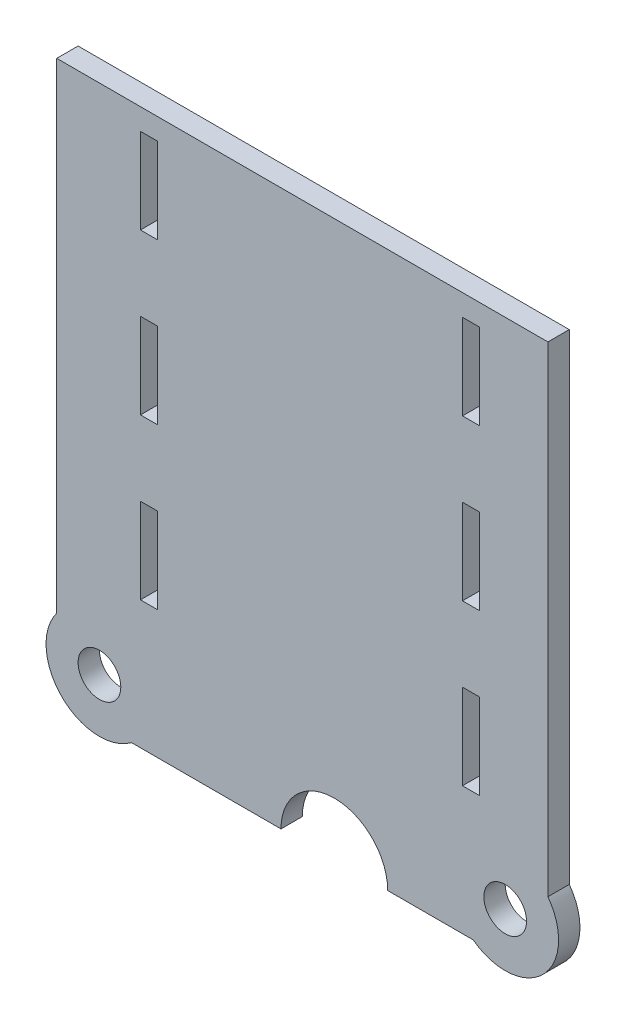
ISO-10303-21;
HEADER;
FILE_DESCRIPTION(('STEP AP214'),'2;1');
FILE_NAME('part.step','',(''),(''),'','','');
FILE_SCHEMA(('AUTOMOTIVE_DESIGN { 1 0 10303 214 1 1 1 1 }'));
ENDSEC;
DATA;
#1=APPLICATION_CONTEXT('core data for automotive mechanical design processes');
#2=APPLICATION_PROTOCOL_DEFINITION('international standard','automotive_design',2000,#1);
#3=PRODUCT_CONTEXT('',#1,'mechanical');
#4=PRODUCT('Part','Part','',(#3));
#5=PRODUCT_RELATED_PRODUCT_CATEGORY('part','',(#4));
#6=PRODUCT_DEFINITION_FORMATION('','',#4);
#7=PRODUCT_DEFINITION_CONTEXT('part definition',#1,'design');
#8=PRODUCT_DEFINITION('design','',#6,#7);
#9=PRODUCT_DEFINITION_SHAPE('','',#8);
#10=(LENGTH_UNIT() NAMED_UNIT(*) SI_UNIT(.MILLI.,.METRE.));
#11=(NAMED_UNIT(*) PLANE_ANGLE_UNIT() SI_UNIT($,.RADIAN.));
#12=(NAMED_UNIT(*) SI_UNIT($,.STERADIAN.) SOLID_ANGLE_UNIT());
#13=UNCERTAINTY_MEASURE_WITH_UNIT(LENGTH_MEASURE(1.E-05),#10,'distance_accuracy_value','');
#14=(GEOMETRIC_REPRESENTATION_CONTEXT(3) GLOBAL_UNCERTAINTY_ASSIGNED_CONTEXT((#13)) GLOBAL_UNIT_ASSIGNED_CONTEXT((#10,
#11,#12)) REPRESENTATION_CONTEXT('',''));
#15=CARTESIAN_POINT('',(0.,0.,0.));
#16=DIRECTION('',(0.,0.,1.));
#17=DIRECTION('',(1.,0.,0.));
#18=AXIS2_PLACEMENT_3D('',#15,#16,#17);
#19=CARTESIAN_POINT('',(0.,-12.7,3.175));
#20=DIRECTION('',(0.,-1.,0.));
#21=DIRECTION('',(1.,0.,0.));
#22=AXIS2_PLACEMENT_3D('',#19,#20,#21);
#23=PLANE('',#22);
#24=DIRECTION('',(0.,0.,1.));
#25=VECTOR('',#24,1.);
#26=CARTESIAN_POINT('',(25.4,-12.7,-3.175));
#27=LINE('',#26,#25);
#28=CARTESIAN_POINT('',(25.4,-12.7,-3.175));
#29=VERTEX_POINT('',#28);
#30=CARTESIAN_POINT('',(25.4,-12.7,3.175));
#31=VERTEX_POINT('',#30);
#32=EDGE_CURVE('E249',#29,#31,#27,.T.);
#33=ORIENTED_EDGE('',*,*,#32,.F.);
#34=DIRECTION('',(-1.,0.,0.));
#35=VECTOR('',#34,1.);
#36=CARTESIAN_POINT('',(0.,-12.7,-3.175));
#37=LINE('',#36,#35);
#38=CARTESIAN_POINT('',(50.8,-12.7,-3.175));
#39=VERTEX_POINT('',#38);
#40=EDGE_CURVE('E259',#39,#29,#37,.T.);
#41=ORIENTED_EDGE('',*,*,#40,.F.);
#42=DIRECTION('',(0.,0.,-1.));
#43=VECTOR('',#42,1.);
#44=CARTESIAN_POINT('',(50.8,-12.7,3.175));
#45=LINE('',#44,#43);
#46=CARTESIAN_POINT('',(50.8,-12.7,3.175));
#47=VERTEX_POINT('',#46);
#48=EDGE_CURVE('E292',#47,#39,#45,.T.);
#49=ORIENTED_EDGE('',*,*,#48,.F.);
#50=DIRECTION('',(-1.,0.,0.));
#51=VECTOR('',#50,1.);
#52=CARTESIAN_POINT('',(0.,-12.7,3.175));
#53=LINE('',#52,#51);
#54=EDGE_CURVE('E262',#47,#31,#53,.T.);
#55=ORIENTED_EDGE('',*,*,#54,.T.);
#56=EDGE_LOOP('',(#33,#41,#49,#55));
#57=FACE_BOUND('',#56,.T.);
#58=ADVANCED_FACE('F41',(#57),#23,.T.);
#59=CARTESIAN_POINT('',(1.15849359091321E-13,152.4,3.175));
#60=DIRECTION('',(0.,1.,0.));
#61=DIRECTION('',(-1.,0.,0.));
#62=AXIS2_PLACEMENT_3D('',#59,#60,#61);
#63=PLANE('',#62);
#64=DIRECTION('',(1.,0.,0.));
#65=VECTOR('',#64,1.);
#66=CARTESIAN_POINT('',(1.15849359091321E-13,152.4,-3.175));
#67=LINE('',#66,#65);
#68=CARTESIAN_POINT('',(-73.025,152.4,-3.175));
#69=VERTEX_POINT('',#68);
#70=CARTESIAN_POINT('',(73.025,152.4,-3.175));
#71=VERTEX_POINT('',#70);
#72=EDGE_CURVE('E313',#69,#71,#67,.T.);
#73=ORIENTED_EDGE('',*,*,#72,.F.);
#74=DIRECTION('',(0.,0.,-1.));
#75=VECTOR('',#74,1.);
#76=CARTESIAN_POINT('',(-73.025,152.4,3.175));
#77=LINE('',#76,#75);
#78=CARTESIAN_POINT('',(-73.025,152.4,3.175));
#79=VERTEX_POINT('',#78);
#80=EDGE_CURVE('E11',#79,#69,#77,.T.);
#81=ORIENTED_EDGE('',*,*,#80,.F.);
#82=DIRECTION('',(1.,0.,0.));
#83=VECTOR('',#82,1.);
#84=CARTESIAN_POINT('',(1.15849359091321E-13,152.4,3.175));
#85=LINE('',#84,#83);
#86=CARTESIAN_POINT('',(73.025,152.4,3.175));
#87=VERTEX_POINT('',#86);
#88=EDGE_CURVE('E286',#79,#87,#85,.T.);
#89=ORIENTED_EDGE('',*,*,#88,.T.);
#90=DIRECTION('',(0.,0.,-1.));
#91=VECTOR('',#90,1.);
#92=CARTESIAN_POINT('',(73.025,152.4,3.175));
#93=LINE('',#92,#91);
#94=EDGE_CURVE('E287',#87,#71,#93,.T.);
#95=ORIENTED_EDGE('',*,*,#94,.T.);
#96=EDGE_LOOP('',(#73,#81,#89,#95));
#97=FACE_BOUND('',#96,.T.);
#98=ADVANCED_FACE('F43',(#97),#63,.T.);
#99=CARTESIAN_POINT('',(-73.025,0.,3.175));
#100=DIRECTION('',(-1.,0.,0.));
#101=DIRECTION('',(0.,0.,1.));
#102=AXIS2_PLACEMENT_3D('',#99,#100,#101);
#103=PLANE('',#102);
#104=DIRECTION('',(0.,1.,0.));
#105=VECTOR('',#104,1.);
#106=CARTESIAN_POINT('',(-73.025,0.,-3.175));
#107=LINE('',#106,#105);
#108=CARTESIAN_POINT('',(-73.025,9.52500000000001,-3.175));
#109=VERTEX_POINT('',#108);
#110=EDGE_CURVE('E310',#109,#69,#107,.T.);
#111=ORIENTED_EDGE('',*,*,#110,.F.);
#112=DIRECTION('',(0.,0.,-1.));
#113=VECTOR('',#112,1.);
#114=CARTESIAN_POINT('',(-73.025,9.52500000000001,3.175));
#115=LINE('',#114,#113);
#116=CARTESIAN_POINT('',(-73.025,9.52500000000001,3.175));
#117=VERTEX_POINT('',#116);
#118=EDGE_CURVE('E49',#117,#109,#115,.T.);
#119=ORIENTED_EDGE('',*,*,#118,.F.);
#120=DIRECTION('',(0.,1.,0.));
#121=VECTOR('',#120,1.);
#122=CARTESIAN_POINT('',(-73.025,0.,3.175));
#123=LINE('',#122,#121);
#124=EDGE_CURVE('E330',#117,#79,#123,.T.);
#125=ORIENTED_EDGE('',*,*,#124,.T.);
#126=ORIENTED_EDGE('',*,*,#80,.T.);
#127=EDGE_LOOP('',(#111,#119,#125,#126));
#128=FACE_BOUND('',#127,.T.);
#129=ADVANCED_FACE('F311',(#128),#103,.T.);
#130=CARTESIAN_POINT('',(-60.325,0.,3.175));
#131=DIRECTION('',(0.,0.,-1.));
#132=DIRECTION('',(-1.,0.,0.));
#133=AXIS2_PLACEMENT_3D('',#130,#131,#132);
#134=CYLINDRICAL_SURFACE('',#133,15.875);
#135=CARTESIAN_POINT('',(-60.325,0.,-3.175));
#136=DIRECTION('',(0.,0.,1.));
#137=DIRECTION('',(1.,0.,0.));
#138=AXIS2_PLACEMENT_3D('',#135,#136,#137);
#139=CIRCLE('',#138,15.875);
#140=CARTESIAN_POINT('',(-50.8,-12.7,-3.175));
#141=VERTEX_POINT('',#140);
#142=EDGE_CURVE('E274',#109,#141,#139,.T.);
#143=ORIENTED_EDGE('',*,*,#142,.T.);
#144=DIRECTION('',(0.,0.,-1.));
#145=VECTOR('',#144,1.);
#146=CARTESIAN_POINT('',(-50.8,-12.7,3.175));
#147=LINE('',#146,#145);
#148=CARTESIAN_POINT('',(-50.8,-12.7,3.175));
#149=VERTEX_POINT('',#148);
#150=EDGE_CURVE('E294',#149,#141,#147,.T.);
#151=ORIENTED_EDGE('',*,*,#150,.F.);
#152=CARTESIAN_POINT('',(-60.325,0.,3.175));
#153=DIRECTION('',(0.,0.,1.));
#154=DIRECTION('',(1.,0.,0.));
#155=AXIS2_PLACEMENT_3D('',#152,#153,#154);
#156=CIRCLE('',#155,15.875);
#157=EDGE_CURVE('E303',#117,#149,#156,.T.);
#158=ORIENTED_EDGE('',*,*,#157,.F.);
#159=ORIENTED_EDGE('',*,*,#118,.T.);
#160=EDGE_LOOP('',(#143,#151,#158,#159));
#161=FACE_BOUND('',#160,.T.);
#162=ADVANCED_FACE('F300',(#161),#134,.T.);
#163=DIRECTION('',(0.,0.,1.));
#164=VECTOR('',#163,1.);
#165=CARTESIAN_POINT('',(-6.35000000000001,-12.7,-3.175));
#166=LINE('',#165,#164);
#167=CARTESIAN_POINT('',(-6.35000000000001,-12.7,3.175));
#168=VERTEX_POINT('',#167);
#169=CARTESIAN_POINT('',(-6.35000000000001,-12.7,-3.175));
#170=VERTEX_POINT('',#169);
#171=EDGE_CURVE('E56',#168,#170,#166,.F.);
#172=ORIENTED_EDGE('',*,*,#171,.F.);
#173=EDGE_CURVE('E328',#168,#149,#53,.T.);
#174=ORIENTED_EDGE('',*,*,#173,.T.);
#175=ORIENTED_EDGE('',*,*,#150,.T.);
#176=EDGE_CURVE('E270',#170,#141,#37,.T.);
#177=ORIENTED_EDGE('',*,*,#176,.F.);
#178=EDGE_LOOP('',(#172,#174,#175,#177));
#179=FACE_BOUND('',#178,.T.);
#180=ADVANCED_FACE('F526',(#179),#23,.T.);
#181=CARTESIAN_POINT('',(60.325,0.,3.175));
#182=DIRECTION('',(0.,0.,-1.));
#183=DIRECTION('',(-1.,0.,0.));
#184=AXIS2_PLACEMENT_3D('',#181,#182,#183);
#185=CYLINDRICAL_SURFACE('',#184,15.875);
#186=CARTESIAN_POINT('',(60.325,0.,-3.175));
#187=DIRECTION('',(0.,0.,1.));
#188=DIRECTION('',(1.,0.,0.));
#189=AXIS2_PLACEMENT_3D('',#186,#187,#188);
#190=CIRCLE('',#189,15.875);
#191=CARTESIAN_POINT('',(73.025,9.525,-3.175));
#192=VERTEX_POINT('',#191);
#193=EDGE_CURVE('E269',#192,#39,#190,.F.);
#194=ORIENTED_EDGE('',*,*,#193,.F.);
#195=DIRECTION('',(0.,0.,-1.));
#196=VECTOR('',#195,1.);
#197=CARTESIAN_POINT('',(73.025,9.525,3.175));
#198=LINE('',#197,#196);
#199=CARTESIAN_POINT('',(73.025,9.525,3.175));
#200=VERTEX_POINT('',#199);
#201=EDGE_CURVE('E289',#200,#192,#198,.T.);
#202=ORIENTED_EDGE('',*,*,#201,.F.);
#203=CARTESIAN_POINT('',(60.325,0.,3.175));
#204=DIRECTION('',(0.,0.,1.));
#205=DIRECTION('',(1.,0.,0.));
#206=AXIS2_PLACEMENT_3D('',#203,#204,#205);
#207=CIRCLE('',#206,15.875);
#208=EDGE_CURVE('E324',#200,#47,#207,.F.);
#209=ORIENTED_EDGE('',*,*,#208,.T.);
#210=ORIENTED_EDGE('',*,*,#48,.T.);
#211=EDGE_LOOP('',(#194,#202,#209,#210));
#212=FACE_BOUND('',#211,.T.);
#213=ADVANCED_FACE('F536',(#212),#185,.T.);
#214=CARTESIAN_POINT('',(-60.325,0.,3.175));
#215=DIRECTION('',(0.,0.,-1.));
#216=DIRECTION('',(-1.,0.,0.));
#217=AXIS2_PLACEMENT_3D('',#214,#215,#216);
#218=CYLINDRICAL_SURFACE('',#217,6.35000000000001);
#219=CARTESIAN_POINT('',(-60.325,0.,3.175));
#220=DIRECTION('',(0.,0.,1.));
#221=DIRECTION('',(1.,0.,0.));
#222=AXIS2_PLACEMENT_3D('',#219,#220,#221);
#223=CIRCLE('',#222,6.35000000000001);
#224=CARTESIAN_POINT('',(-53.975,0.,3.175));
#225=VERTEX_POINT('',#224);
#226=EDGE_CURVE('E319',#225,#225,#223,.T.);
#227=ORIENTED_EDGE('',*,*,#226,.T.);
#228=EDGE_LOOP('',(#227));
#229=FACE_BOUND('',#228,.T.);
#230=CARTESIAN_POINT('',(-60.325,0.,-3.175));
#231=DIRECTION('',(0.,0.,1.));
#232=DIRECTION('',(1.,0.,0.));
#233=AXIS2_PLACEMENT_3D('',#230,#231,#232);
#234=CIRCLE('',#233,6.35000000000001);
#235=CARTESIAN_POINT('',(-53.975,0.,-3.175));
#236=VERTEX_POINT('',#235);
#237=EDGE_CURVE('E280',#236,#236,#234,.T.);
#238=ORIENTED_EDGE('',*,*,#237,.F.);
#239=EDGE_LOOP('',(#238));
#240=FACE_BOUND('',#239,.T.);
#241=ADVANCED_FACE('F540',(#229,#240),#218,.F.);
#242=CARTESIAN_POINT('',(73.025,0.,3.175));
#243=DIRECTION('',(-1.,0.,0.));
#244=DIRECTION('',(0.,0.,1.));
#245=AXIS2_PLACEMENT_3D('',#242,#243,#244);
#246=PLANE('',#245);
#247=DIRECTION('',(0.,1.,0.));
#248=VECTOR('',#247,1.);
#249=CARTESIAN_POINT('',(73.025,0.,-3.175));
#250=LINE('',#249,#248);
#251=EDGE_CURVE('E272',#192,#71,#250,.T.);
#252=ORIENTED_EDGE('',*,*,#251,.T.);
#253=ORIENTED_EDGE('',*,*,#94,.F.);
#254=DIRECTION('',(0.,1.,0.));
#255=VECTOR('',#254,1.);
#256=CARTESIAN_POINT('',(73.025,0.,3.175));
#257=LINE('',#256,#255);
#258=EDGE_CURVE('E322',#200,#87,#257,.T.);
#259=ORIENTED_EDGE('',*,*,#258,.F.);
#260=ORIENTED_EDGE('',*,*,#201,.T.);
#261=EDGE_LOOP('',(#252,#253,#259,#260));
#262=FACE_BOUND('',#261,.T.);
#263=ADVANCED_FACE('F537',(#262),#246,.F.);
#264=CARTESIAN_POINT('',(60.325,0.,3.175));
#265=DIRECTION('',(0.,0.,-1.));
#266=DIRECTION('',(-1.,0.,0.));
#267=AXIS2_PLACEMENT_3D('',#264,#265,#266);
#268=CYLINDRICAL_SURFACE('',#267,6.35000000000001);
#269=CARTESIAN_POINT('',(60.325,0.,3.175));
#270=DIRECTION('',(0.,0.,1.));
#271=DIRECTION('',(1.,0.,0.));
#272=AXIS2_PLACEMENT_3D('',#269,#270,#271);
#273=CIRCLE('',#272,6.35000000000001);
#274=CARTESIAN_POINT('',(66.675,0.,3.175));
#275=VERTEX_POINT('',#274);
#276=EDGE_CURVE('E290',#275,#275,#273,.F.);
#277=ORIENTED_EDGE('',*,*,#276,.F.);
#278=EDGE_LOOP('',(#277));
#279=FACE_BOUND('',#278,.T.);
#280=CARTESIAN_POINT('',(60.325,0.,-3.175));
#281=DIRECTION('',(0.,0.,1.));
#282=DIRECTION('',(1.,0.,0.));
#283=AXIS2_PLACEMENT_3D('',#280,#281,#282);
#284=CIRCLE('',#283,6.35000000000001);
#285=CARTESIAN_POINT('',(66.675,0.,-3.175));
#286=VERTEX_POINT('',#285);
#287=EDGE_CURVE('E283',#286,#286,#284,.F.);
#288=ORIENTED_EDGE('',*,*,#287,.T.);
#289=EDGE_LOOP('',(#288));
#290=FACE_BOUND('',#289,.T.);
#291=ADVANCED_FACE('F539',(#279,#290),#268,.F.);
#292=CARTESIAN_POINT('',(0.,0.,3.175));
#293=DIRECTION('',(0.,0.,1.));
#294=DIRECTION('',(1.,0.,0.));
#295=AXIS2_PLACEMENT_3D('',#292,#293,#294);
#296=PLANE('',#295);
#297=CARTESIAN_POINT('',(9.52499999999999,-12.7,3.175));
#298=DIRECTION('',(0.,0.,1.));
#299=DIRECTION('',(1.,0.,0.));
#300=AXIS2_PLACEMENT_3D('',#297,#298,#299);
#301=CIRCLE('',#300,15.875);
#302=EDGE_CURVE('E254',#31,#168,#301,.T.);
#303=ORIENTED_EDGE('',*,*,#302,.F.);
#304=ORIENTED_EDGE('',*,*,#54,.F.);
#305=ORIENTED_EDGE('',*,*,#208,.F.);
#306=ORIENTED_EDGE('',*,*,#258,.T.);
#307=ORIENTED_EDGE('',*,*,#88,.F.);
#308=ORIENTED_EDGE('',*,*,#124,.F.);
#309=ORIENTED_EDGE('',*,*,#157,.T.);
#310=ORIENTED_EDGE('',*,*,#173,.F.);
#311=EDGE_LOOP('',(#303,#304,#305,#306,#307,#308,#309,#310));
#312=FACE_BOUND('',#311,.T.);
#313=DIRECTION('',(0.,-1.,0.));
#314=VECTOR('',#313,1.);
#315=CARTESIAN_POINT('',(-48.133,98.425,3.175));
#316=LINE('',#315,#314);
#317=CARTESIAN_POINT('',(-48.133,98.425,3.175));
#318=VERTEX_POINT('',#317);
#319=CARTESIAN_POINT('',(-48.133,73.025,3.175));
#320=VERTEX_POINT('',#319);
#321=EDGE_CURVE('E64',#318,#320,#316,.T.);
#322=ORIENTED_EDGE('',*,*,#321,.F.);
#323=DIRECTION('',(-1.,0.,0.));
#324=VECTOR('',#323,1.);
#325=CARTESIAN_POINT('',(-48.133,98.425,3.175));
#326=LINE('',#325,#324);
#327=CARTESIAN_POINT('',(-43.053,98.425,3.175));
#328=VERTEX_POINT('',#327);
#329=EDGE_CURVE('E471',#328,#318,#326,.T.);
#330=ORIENTED_EDGE('',*,*,#329,.F.);
#331=DIRECTION('',(0.,1.,0.));
#332=VECTOR('',#331,1.);
#333=CARTESIAN_POINT('',(-43.053,98.425,3.175));
#334=LINE('',#333,#332);
#335=CARTESIAN_POINT('',(-43.053,73.025,3.175));
#336=VERTEX_POINT('',#335);
#337=EDGE_CURVE('E475',#336,#328,#334,.T.);
#338=ORIENTED_EDGE('',*,*,#337,.F.);
#339=DIRECTION('',(1.,0.,0.));
#340=VECTOR('',#339,1.);
#341=CARTESIAN_POINT('',(-48.133,73.025,3.175));
#342=LINE('',#341,#340);
#343=EDGE_CURVE('E478',#320,#336,#342,.T.);
#344=ORIENTED_EDGE('',*,*,#343,.F.);
#345=EDGE_LOOP('',(#322,#330,#338,#344));
#346=FACE_BOUND('',#345,.T.);
#347=DIRECTION('',(0.,-1.,0.));
#348=VECTOR('',#347,1.);
#349=CARTESIAN_POINT('',(-48.133,50.8,3.175));
#350=LINE('',#349,#348);
#351=CARTESIAN_POINT('',(-48.133,50.8,3.175));
#352=VERTEX_POINT('',#351);
#353=CARTESIAN_POINT('',(-48.133,25.4,3.175));
#354=VERTEX_POINT('',#353);
#355=EDGE_CURVE('E410',#352,#354,#350,.T.);
#356=ORIENTED_EDGE('',*,*,#355,.F.);
#357=DIRECTION('',(-1.,0.,0.));
#358=VECTOR('',#357,1.);
#359=CARTESIAN_POINT('',(-48.133,50.8,3.175));
#360=LINE('',#359,#358);
#361=CARTESIAN_POINT('',(-43.053,50.8,3.175));
#362=VERTEX_POINT('',#361);
#363=EDGE_CURVE('E442',#362,#352,#360,.T.);
#364=ORIENTED_EDGE('',*,*,#363,.F.);
#365=DIRECTION('',(0.,1.,0.));
#366=VECTOR('',#365,1.);
#367=CARTESIAN_POINT('',(-43.053,50.8,3.175));
#368=LINE('',#367,#366);
#369=CARTESIAN_POINT('',(-43.053,25.4,3.175));
#370=VERTEX_POINT('',#369);
#371=EDGE_CURVE('E446',#370,#362,#368,.T.);
#372=ORIENTED_EDGE('',*,*,#371,.F.);
#373=DIRECTION('',(1.,0.,0.));
#374=VECTOR('',#373,1.);
#375=CARTESIAN_POINT('',(-48.133,25.4,3.175));
#376=LINE('',#375,#374);
#377=EDGE_CURVE('E449',#354,#370,#376,.T.);
#378=ORIENTED_EDGE('',*,*,#377,.F.);
#379=EDGE_LOOP('',(#356,#364,#372,#378));
#380=FACE_BOUND('',#379,.T.);
#381=DIRECTION('',(0.,-1.,0.));
#382=VECTOR('',#381,1.);
#383=CARTESIAN_POINT('',(47.625,146.05,3.175));
#384=LINE('',#383,#382);
#385=CARTESIAN_POINT('',(47.625,146.05,3.175));
#386=VERTEX_POINT('',#385);
#387=CARTESIAN_POINT('',(47.625,120.65,3.175));
#388=VERTEX_POINT('',#387);
#389=EDGE_CURVE('E376',#386,#388,#384,.T.);
#390=ORIENTED_EDGE('',*,*,#389,.F.);
#391=DIRECTION('',(-1.,0.,0.));
#392=VECTOR('',#391,1.);
#393=CARTESIAN_POINT('',(47.625,146.05,3.175));
#394=LINE('',#393,#392);
#395=CARTESIAN_POINT('',(52.705,146.05,3.175));
#396=VERTEX_POINT('',#395);
#397=EDGE_CURVE('E411',#396,#386,#394,.T.);
#398=ORIENTED_EDGE('',*,*,#397,.F.);
#399=DIRECTION('',(0.,1.,0.));
#400=VECTOR('',#399,1.);
#401=CARTESIAN_POINT('',(52.705,146.05,3.175));
#402=LINE('',#401,#400);
#403=CARTESIAN_POINT('',(52.705,120.65,3.175));
#404=VERTEX_POINT('',#403);
#405=EDGE_CURVE('E415',#404,#396,#402,.T.);
#406=ORIENTED_EDGE('',*,*,#405,.F.);
#407=DIRECTION('',(1.,0.,0.));
#408=VECTOR('',#407,1.);
#409=CARTESIAN_POINT('',(47.625,120.65,3.175));
#410=LINE('',#409,#408);
#411=EDGE_CURVE('E418',#388,#404,#410,.T.);
#412=ORIENTED_EDGE('',*,*,#411,.F.);
#413=EDGE_LOOP('',(#390,#398,#406,#412));
#414=FACE_BOUND('',#413,.T.);
#415=DIRECTION('',(-1.,0.,0.));
#416=VECTOR('',#415,1.);
#417=CARTESIAN_POINT('',(47.625,98.425,3.175));
#418=LINE('',#417,#416);
#419=CARTESIAN_POINT('',(52.705,98.425,3.175));
#420=VERTEX_POINT('',#419);
#421=CARTESIAN_POINT('',(47.625,98.425,3.175));
#422=VERTEX_POINT('',#421);
#423=EDGE_CURVE('E387',#420,#422,#418,.T.);
#424=ORIENTED_EDGE('',*,*,#423,.F.);
#425=DIRECTION('',(0.,1.,0.));
#426=VECTOR('',#425,1.);
#427=CARTESIAN_POINT('',(52.705,98.425,3.175));
#428=LINE('',#427,#426);
#429=CARTESIAN_POINT('',(52.705,73.025,3.175));
#430=VERTEX_POINT('',#429);
#431=EDGE_CURVE('E377',#430,#420,#428,.T.);
#432=ORIENTED_EDGE('',*,*,#431,.F.);
#433=DIRECTION('',(1.,0.,0.));
#434=VECTOR('',#433,1.);
#435=CARTESIAN_POINT('',(47.625,73.025,3.175));
#436=LINE('',#435,#434);
#437=CARTESIAN_POINT('',(47.625,73.025,3.175));
#438=VERTEX_POINT('',#437);
#439=EDGE_CURVE('E381',#438,#430,#436,.T.);
#440=ORIENTED_EDGE('',*,*,#439,.F.);
#441=DIRECTION('',(0.,-1.,0.));
#442=VECTOR('',#441,1.);
#443=CARTESIAN_POINT('',(47.625,98.425,3.175));
#444=LINE('',#443,#442);
#445=EDGE_CURVE('E384',#422,#438,#444,.T.);
#446=ORIENTED_EDGE('',*,*,#445,.F.);
#447=EDGE_LOOP('',(#424,#432,#440,#446));
#448=FACE_BOUND('',#447,.T.);
#449=DIRECTION('',(-1.,0.,0.));
#450=VECTOR('',#449,1.);
#451=CARTESIAN_POINT('',(47.625,50.8,3.175));
#452=LINE('',#451,#450);
#453=CARTESIAN_POINT('',(52.705,50.8,3.175));
#454=VERTEX_POINT('',#453);
#455=CARTESIAN_POINT('',(47.625,50.8,3.175));
#456=VERTEX_POINT('',#455);
#457=EDGE_CURVE('E263',#454,#456,#452,.T.);
#458=ORIENTED_EDGE('',*,*,#457,.F.);
#459=DIRECTION('',(0.,1.,0.));
#460=VECTOR('',#459,1.);
#461=CARTESIAN_POINT('',(52.705,50.8,3.175));
#462=LINE('',#461,#460);
#463=CARTESIAN_POINT('',(52.705,25.4,3.175));
#464=VERTEX_POINT('',#463);
#465=EDGE_CURVE('E501',#464,#454,#462,.T.);
#466=ORIENTED_EDGE('',*,*,#465,.F.);
#467=DIRECTION('',(1.,0.,0.));
#468=VECTOR('',#467,1.);
#469=CARTESIAN_POINT('',(47.625,25.4,3.175));
#470=LINE('',#469,#468);
#471=CARTESIAN_POINT('',(47.625,25.4,3.175));
#472=VERTEX_POINT('',#471);
#473=EDGE_CURVE('E505',#472,#464,#470,.T.);
#474=ORIENTED_EDGE('',*,*,#473,.F.);
#475=DIRECTION('',(0.,-1.,0.));
#476=VECTOR('',#475,1.);
#477=CARTESIAN_POINT('',(47.625,50.8,3.175));
#478=LINE('',#477,#476);
#479=EDGE_CURVE('E508',#456,#472,#478,.T.);
#480=ORIENTED_EDGE('',*,*,#479,.F.);
#481=EDGE_LOOP('',(#458,#466,#474,#480));
#482=FACE_BOUND('',#481,.T.);
#483=DIRECTION('',(0.,-1.,0.));
#484=VECTOR('',#483,1.);
#485=CARTESIAN_POINT('',(-48.133,146.05,3.175));
#486=LINE('',#485,#484);
#487=CARTESIAN_POINT('',(-48.133,146.05,3.175));
#488=VERTEX_POINT('',#487);
#489=CARTESIAN_POINT('',(-48.133,120.65,3.175));
#490=VERTEX_POINT('',#489);
#491=EDGE_CURVE('E353',#488,#490,#486,.T.);
#492=ORIENTED_EDGE('',*,*,#491,.F.);
#493=DIRECTION('',(-1.,0.,0.));
#494=VECTOR('',#493,1.);
#495=CARTESIAN_POINT('',(-48.133,146.05,3.175));
#496=LINE('',#495,#494);
#497=CARTESIAN_POINT('',(-43.053,146.05,3.175));
#498=VERTEX_POINT('',#497);
#499=EDGE_CURVE('E343',#498,#488,#496,.T.);
#500=ORIENTED_EDGE('',*,*,#499,.F.);
#501=DIRECTION('',(0.,1.,0.));
#502=VECTOR('',#501,1.);
#503=CARTESIAN_POINT('',(-43.053,146.05,3.175));
#504=LINE('',#503,#502);
#505=CARTESIAN_POINT('',(-43.053,120.65,3.175));
#506=VERTEX_POINT('',#505);
#507=EDGE_CURVE('E347',#506,#498,#504,.T.);
#508=ORIENTED_EDGE('',*,*,#507,.F.);
#509=DIRECTION('',(1.,0.,0.));
#510=VECTOR('',#509,1.);
#511=CARTESIAN_POINT('',(-48.133,120.65,3.175));
#512=LINE('',#511,#510);
#513=EDGE_CURVE('E350',#490,#506,#512,.T.);
#514=ORIENTED_EDGE('',*,*,#513,.F.);
#515=EDGE_LOOP('',(#492,#500,#508,#514));
#516=FACE_BOUND('',#515,.T.);
#517=ORIENTED_EDGE('',*,*,#226,.F.);
#518=EDGE_LOOP('',(#517));
#519=FACE_BOUND('',#518,.T.);
#520=ORIENTED_EDGE('',*,*,#276,.T.);
#521=EDGE_LOOP('',(#520));
#522=FACE_BOUND('',#521,.T.);
#523=ADVANCED_FACE('F527',(#312,#346,#380,#414,#448,#482,#516,#519,#522),#296,.T.);
#524=CARTESIAN_POINT('',(0.,0.,-3.175));
#525=DIRECTION('',(0.,0.,1.));
#526=DIRECTION('',(1.,0.,0.));
#527=AXIS2_PLACEMENT_3D('',#524,#525,#526);
#528=PLANE('',#527);
#529=DIRECTION('',(-1.,0.,0.));
#530=VECTOR('',#529,1.);
#531=CARTESIAN_POINT('',(-48.133,98.425,-3.175));
#532=LINE('',#531,#530);
#533=CARTESIAN_POINT('',(-43.053,98.425,-3.175));
#534=VERTEX_POINT('',#533);
#535=CARTESIAN_POINT('',(-48.133,98.425,-3.175));
#536=VERTEX_POINT('',#535);
#537=EDGE_CURVE('E466',#534,#536,#532,.T.);
#538=ORIENTED_EDGE('',*,*,#537,.T.);
#539=DIRECTION('',(0.,-1.,0.));
#540=VECTOR('',#539,1.);
#541=CARTESIAN_POINT('',(-48.133,98.425,-3.175));
#542=LINE('',#541,#540);
#543=CARTESIAN_POINT('',(-48.133,73.025,-3.175));
#544=VERTEX_POINT('',#543);
#545=EDGE_CURVE('E474',#536,#544,#542,.T.);
#546=ORIENTED_EDGE('',*,*,#545,.T.);
#547=DIRECTION('',(1.,0.,0.));
#548=VECTOR('',#547,1.);
#549=CARTESIAN_POINT('',(-48.133,73.025,-3.175));
#550=LINE('',#549,#548);
#551=CARTESIAN_POINT('',(-43.053,73.025,-3.175));
#552=VERTEX_POINT('',#551);
#553=EDGE_CURVE('E487',#544,#552,#550,.T.);
#554=ORIENTED_EDGE('',*,*,#553,.T.);
#555=DIRECTION('',(0.,1.,0.));
#556=VECTOR('',#555,1.);
#557=CARTESIAN_POINT('',(-43.053,98.425,-3.175));
#558=LINE('',#557,#556);
#559=EDGE_CURVE('E484',#552,#534,#558,.T.);
#560=ORIENTED_EDGE('',*,*,#559,.T.);
#561=EDGE_LOOP('',(#538,#546,#554,#560));
#562=FACE_BOUND('',#561,.T.);
#563=DIRECTION('',(-1.,0.,0.));
#564=VECTOR('',#563,1.);
#565=CARTESIAN_POINT('',(-48.133,50.8,-3.175));
#566=LINE('',#565,#564);
#567=CARTESIAN_POINT('',(-43.053,50.8,-3.175));
#568=VERTEX_POINT('',#567);
#569=CARTESIAN_POINT('',(-48.133,50.8,-3.175));
#570=VERTEX_POINT('',#569);
#571=EDGE_CURVE('E436',#568,#570,#566,.T.);
#572=ORIENTED_EDGE('',*,*,#571,.T.);
#573=DIRECTION('',(0.,-1.,0.));
#574=VECTOR('',#573,1.);
#575=CARTESIAN_POINT('',(-48.133,50.8,-3.175));
#576=LINE('',#575,#574);
#577=CARTESIAN_POINT('',(-48.133,25.4,-3.175));
#578=VERTEX_POINT('',#577);
#579=EDGE_CURVE('E445',#570,#578,#576,.T.);
#580=ORIENTED_EDGE('',*,*,#579,.T.);
#581=DIRECTION('',(1.,0.,0.));
#582=VECTOR('',#581,1.);
#583=CARTESIAN_POINT('',(-48.133,25.4,-3.175));
#584=LINE('',#583,#582);
#585=CARTESIAN_POINT('',(-43.053,25.4,-3.175));
#586=VERTEX_POINT('',#585);
#587=EDGE_CURVE('E458',#578,#586,#584,.T.);
#588=ORIENTED_EDGE('',*,*,#587,.T.);
#589=DIRECTION('',(0.,1.,0.));
#590=VECTOR('',#589,1.);
#591=CARTESIAN_POINT('',(-43.053,50.8,-3.175));
#592=LINE('',#591,#590);
#593=EDGE_CURVE('E455',#586,#568,#592,.T.);
#594=ORIENTED_EDGE('',*,*,#593,.T.);
#595=EDGE_LOOP('',(#572,#580,#588,#594));
#596=FACE_BOUND('',#595,.T.);
#597=DIRECTION('',(-1.,0.,0.));
#598=VECTOR('',#597,1.);
#599=CARTESIAN_POINT('',(47.625,146.05,-3.175));
#600=LINE('',#599,#598);
#601=CARTESIAN_POINT('',(52.705,146.05,-3.175));
#602=VERTEX_POINT('',#601);
#603=CARTESIAN_POINT('',(47.625,146.05,-3.175));
#604=VERTEX_POINT('',#603);
#605=EDGE_CURVE('E404',#602,#604,#600,.T.);
#606=ORIENTED_EDGE('',*,*,#605,.T.);
#607=DIRECTION('',(0.,-1.,0.));
#608=VECTOR('',#607,1.);
#609=CARTESIAN_POINT('',(47.625,146.05,-3.175));
#610=LINE('',#609,#608);
#611=CARTESIAN_POINT('',(47.625,120.65,-3.175));
#612=VERTEX_POINT('',#611);
#613=EDGE_CURVE('E414',#604,#612,#610,.T.);
#614=ORIENTED_EDGE('',*,*,#613,.T.);
#615=DIRECTION('',(1.,0.,0.));
#616=VECTOR('',#615,1.);
#617=CARTESIAN_POINT('',(47.625,120.65,-3.175));
#618=LINE('',#617,#616);
#619=CARTESIAN_POINT('',(52.705,120.65,-3.175));
#620=VERTEX_POINT('',#619);
#621=EDGE_CURVE('E427',#612,#620,#618,.T.);
#622=ORIENTED_EDGE('',*,*,#621,.T.);
#623=DIRECTION('',(0.,1.,0.));
#624=VECTOR('',#623,1.);
#625=CARTESIAN_POINT('',(52.705,146.05,-3.175));
#626=LINE('',#625,#624);
#627=EDGE_CURVE('E424',#620,#602,#626,.T.);
#628=ORIENTED_EDGE('',*,*,#627,.T.);
#629=EDGE_LOOP('',(#606,#614,#622,#628));
#630=FACE_BOUND('',#629,.T.);
#631=DIRECTION('',(0.,1.,0.));
#632=VECTOR('',#631,1.);
#633=CARTESIAN_POINT('',(52.705,98.425,-3.175));
#634=LINE('',#633,#632);
#635=CARTESIAN_POINT('',(52.705,73.025,-3.175));
#636=VERTEX_POINT('',#635);
#637=CARTESIAN_POINT('',(52.705,98.425,-3.175));
#638=VERTEX_POINT('',#637);
#639=EDGE_CURVE('E370',#636,#638,#634,.T.);
#640=ORIENTED_EDGE('',*,*,#639,.T.);
#641=DIRECTION('',(-1.,0.,0.));
#642=VECTOR('',#641,1.);
#643=CARTESIAN_POINT('',(47.625,98.425,-3.175));
#644=LINE('',#643,#642);
#645=CARTESIAN_POINT('',(47.625,98.425,-3.175));
#646=VERTEX_POINT('',#645);
#647=EDGE_CURVE('E380',#638,#646,#644,.T.);
#648=ORIENTED_EDGE('',*,*,#647,.T.);
#649=DIRECTION('',(0.,-1.,0.));
#650=VECTOR('',#649,1.);
#651=CARTESIAN_POINT('',(47.625,98.425,-3.175));
#652=LINE('',#651,#650);
#653=CARTESIAN_POINT('',(47.625,73.025,-3.175));
#654=VERTEX_POINT('',#653);
#655=EDGE_CURVE('E395',#646,#654,#652,.T.);
#656=ORIENTED_EDGE('',*,*,#655,.T.);
#657=DIRECTION('',(1.,0.,0.));
#658=VECTOR('',#657,1.);
#659=CARTESIAN_POINT('',(47.625,73.025,-3.175));
#660=LINE('',#659,#658);
#661=EDGE_CURVE('E392',#654,#636,#660,.T.);
#662=ORIENTED_EDGE('',*,*,#661,.T.);
#663=EDGE_LOOP('',(#640,#648,#656,#662));
#664=FACE_BOUND('',#663,.T.);
#665=DIRECTION('',(0.,1.,0.));
#666=VECTOR('',#665,1.);
#667=CARTESIAN_POINT('',(52.705,50.8,-3.175));
#668=LINE('',#667,#666);
#669=CARTESIAN_POINT('',(52.705,25.4,-3.175));
#670=VERTEX_POINT('',#669);
#671=CARTESIAN_POINT('',(52.705,50.8,-3.175));
#672=VERTEX_POINT('',#671);
#673=EDGE_CURVE('E496',#670,#672,#668,.T.);
#674=ORIENTED_EDGE('',*,*,#673,.T.);
#675=DIRECTION('',(-1.,0.,0.));
#676=VECTOR('',#675,1.);
#677=CARTESIAN_POINT('',(47.625,50.8,-3.175));
#678=LINE('',#677,#676);
#679=CARTESIAN_POINT('',(47.625,50.8,-3.175));
#680=VERTEX_POINT('',#679);
#681=EDGE_CURVE('E504',#672,#680,#678,.T.);
#682=ORIENTED_EDGE('',*,*,#681,.T.);
#683=DIRECTION('',(0.,-1.,0.));
#684=VECTOR('',#683,1.);
#685=CARTESIAN_POINT('',(47.625,50.8,-3.175));
#686=LINE('',#685,#684);
#687=CARTESIAN_POINT('',(47.625,25.4,-3.175));
#688=VERTEX_POINT('',#687);
#689=EDGE_CURVE('E517',#680,#688,#686,.T.);
#690=ORIENTED_EDGE('',*,*,#689,.T.);
#691=DIRECTION('',(1.,0.,0.));
#692=VECTOR('',#691,1.);
#693=CARTESIAN_POINT('',(47.625,25.4,-3.175));
#694=LINE('',#693,#692);
#695=EDGE_CURVE('E514',#688,#670,#694,.T.);
#696=ORIENTED_EDGE('',*,*,#695,.T.);
#697=EDGE_LOOP('',(#674,#682,#690,#696));
#698=FACE_BOUND('',#697,.T.);
#699=DIRECTION('',(-1.,0.,0.));
#700=VECTOR('',#699,1.);
#701=CARTESIAN_POINT('',(-48.133,146.05,-3.175));
#702=LINE('',#701,#700);
#703=CARTESIAN_POINT('',(-43.053,146.05,-3.175));
#704=VERTEX_POINT('',#703);
#705=CARTESIAN_POINT('',(-48.133,146.05,-3.175));
#706=VERTEX_POINT('',#705);
#707=EDGE_CURVE('E338',#704,#706,#702,.T.);
#708=ORIENTED_EDGE('',*,*,#707,.T.);
#709=DIRECTION('',(0.,-1.,0.));
#710=VECTOR('',#709,1.);
#711=CARTESIAN_POINT('',(-48.133,146.05,-3.175));
#712=LINE('',#711,#710);
#713=CARTESIAN_POINT('',(-48.133,120.65,-3.175));
#714=VERTEX_POINT('',#713);
#715=EDGE_CURVE('E346',#706,#714,#712,.T.);
#716=ORIENTED_EDGE('',*,*,#715,.T.);
#717=DIRECTION('',(1.,0.,0.));
#718=VECTOR('',#717,1.);
#719=CARTESIAN_POINT('',(-48.133,120.65,-3.175));
#720=LINE('',#719,#718);
#721=CARTESIAN_POINT('',(-43.053,120.65,-3.175));
#722=VERTEX_POINT('',#721);
#723=EDGE_CURVE('E361',#714,#722,#720,.T.);
#724=ORIENTED_EDGE('',*,*,#723,.T.);
#725=DIRECTION('',(0.,1.,0.));
#726=VECTOR('',#725,1.);
#727=CARTESIAN_POINT('',(-43.053,146.05,-3.175));
#728=LINE('',#727,#726);
#729=EDGE_CURVE('E358',#722,#704,#728,.T.);
#730=ORIENTED_EDGE('',*,*,#729,.T.);
#731=EDGE_LOOP('',(#708,#716,#724,#730));
#732=FACE_BOUND('',#731,.T.);
#733=ORIENTED_EDGE('',*,*,#40,.T.);
#734=CARTESIAN_POINT('',(9.52499999999999,-12.7,-3.175));
#735=DIRECTION('',(0.,0.,1.));
#736=DIRECTION('',(1.,0.,0.));
#737=AXIS2_PLACEMENT_3D('',#734,#735,#736);
#738=CIRCLE('',#737,15.875);
#739=EDGE_CURVE('E246',#29,#170,#738,.T.);
#740=ORIENTED_EDGE('',*,*,#739,.T.);
#741=ORIENTED_EDGE('',*,*,#176,.T.);
#742=ORIENTED_EDGE('',*,*,#142,.F.);
#743=ORIENTED_EDGE('',*,*,#110,.T.);
#744=ORIENTED_EDGE('',*,*,#72,.T.);
#745=ORIENTED_EDGE('',*,*,#251,.F.);
#746=ORIENTED_EDGE('',*,*,#193,.T.);
#747=EDGE_LOOP('',(#733,#740,#741,#742,#743,#744,#745,#746));
#748=FACE_BOUND('',#747,.T.);
#749=ORIENTED_EDGE('',*,*,#237,.T.);
#750=EDGE_LOOP('',(#749));
#751=FACE_BOUND('',#750,.T.);
#752=ORIENTED_EDGE('',*,*,#287,.F.);
#753=EDGE_LOOP('',(#752));
#754=FACE_BOUND('',#753,.T.);
#755=ADVANCED_FACE('F265',(#562,#596,#630,#664,#698,#732,#748,#751,#754),#528,.F.);
#756=CARTESIAN_POINT('',(-48.133,146.05,-3.175));
#757=DIRECTION('',(-1.,0.,0.));
#758=DIRECTION('',(0.,-1.,0.));
#759=AXIS2_PLACEMENT_3D('',#756,#757,#758);
#760=PLANE('',#759);
#761=ORIENTED_EDGE('',*,*,#491,.T.);
#762=DIRECTION('',(0.,0.,1.));
#763=VECTOR('',#762,1.);
#764=CARTESIAN_POINT('',(-48.133,120.65,-3.175));
#765=LINE('',#764,#763);
#766=EDGE_CURVE('E334',#714,#490,#765,.T.);
#767=ORIENTED_EDGE('',*,*,#766,.F.);
#768=ORIENTED_EDGE('',*,*,#715,.F.);
#769=DIRECTION('',(0.,0.,1.));
#770=VECTOR('',#769,1.);
#771=CARTESIAN_POINT('',(-48.133,146.05,-3.175));
#772=LINE('',#771,#770);
#773=EDGE_CURVE('E314',#706,#488,#772,.T.);
#774=ORIENTED_EDGE('',*,*,#773,.T.);
#775=EDGE_LOOP('',(#761,#767,#768,#774));
#776=FACE_BOUND('',#775,.T.);
#777=ADVANCED_FACE('F622',(#776),#760,.F.);
#778=CARTESIAN_POINT('',(-48.133,146.05,-3.175));
#779=DIRECTION('',(0.,1.,0.));
#780=DIRECTION('',(0.,0.,1.));
#781=AXIS2_PLACEMENT_3D('',#778,#779,#780);
#782=PLANE('',#781);
#783=ORIENTED_EDGE('',*,*,#499,.T.);
#784=ORIENTED_EDGE('',*,*,#773,.F.);
#785=ORIENTED_EDGE('',*,*,#707,.F.);
#786=DIRECTION('',(0.,0.,1.));
#787=VECTOR('',#786,1.);
#788=CARTESIAN_POINT('',(-43.053,146.05,-3.175));
#789=LINE('',#788,#787);
#790=EDGE_CURVE('E340',#704,#498,#789,.T.);
#791=ORIENTED_EDGE('',*,*,#790,.T.);
#792=EDGE_LOOP('',(#783,#784,#785,#791));
#793=FACE_BOUND('',#792,.T.);
#794=ADVANCED_FACE('F630',(#793),#782,.F.);
#795=CARTESIAN_POINT('',(-43.053,146.05,-3.175));
#796=DIRECTION('',(1.,0.,0.));
#797=DIRECTION('',(0.,0.,-1.));
#798=AXIS2_PLACEMENT_3D('',#795,#796,#797);
#799=PLANE('',#798);
#800=ORIENTED_EDGE('',*,*,#507,.T.);
#801=ORIENTED_EDGE('',*,*,#790,.F.);
#802=ORIENTED_EDGE('',*,*,#729,.F.);
#803=DIRECTION('',(0.,0.,1.));
#804=VECTOR('',#803,1.);
#805=CARTESIAN_POINT('',(-43.053,120.65,-3.175));
#806=LINE('',#805,#804);
#807=EDGE_CURVE('E337',#722,#506,#806,.T.);
#808=ORIENTED_EDGE('',*,*,#807,.T.);
#809=EDGE_LOOP('',(#800,#801,#802,#808));
#810=FACE_BOUND('',#809,.T.);
#811=ADVANCED_FACE('F639',(#810),#799,.F.);
#812=CARTESIAN_POINT('',(-48.133,120.65,-3.175));
#813=DIRECTION('',(0.,-1.,0.));
#814=DIRECTION('',(0.,0.,-1.));
#815=AXIS2_PLACEMENT_3D('',#812,#813,#814);
#816=PLANE('',#815);
#817=ORIENTED_EDGE('',*,*,#513,.T.);
#818=ORIENTED_EDGE('',*,*,#807,.F.);
#819=ORIENTED_EDGE('',*,*,#723,.F.);
#820=ORIENTED_EDGE('',*,*,#766,.T.);
#821=EDGE_LOOP('',(#817,#818,#819,#820));
#822=FACE_BOUND('',#821,.T.);
#823=ADVANCED_FACE('F648',(#822),#816,.F.);
#824=CARTESIAN_POINT('',(47.625,50.8,-3.175));
#825=DIRECTION('',(0.,1.,0.));
#826=DIRECTION('',(0.,0.,1.));
#827=AXIS2_PLACEMENT_3D('',#824,#825,#826);
#828=PLANE('',#827);
#829=ORIENTED_EDGE('',*,*,#457,.T.);
#830=DIRECTION('',(0.,0.,1.));
#831=VECTOR('',#830,1.);
#832=CARTESIAN_POINT('',(47.625,50.8,-3.175));
#833=LINE('',#832,#831);
#834=EDGE_CURVE('E492',#680,#456,#833,.T.);
#835=ORIENTED_EDGE('',*,*,#834,.F.);
#836=ORIENTED_EDGE('',*,*,#681,.F.);
#837=DIRECTION('',(0.,0.,1.));
#838=VECTOR('',#837,1.);
#839=CARTESIAN_POINT('',(52.705,50.8,-3.175));
#840=LINE('',#839,#838);
#841=EDGE_CURVE('E389',#672,#454,#840,.T.);
#842=ORIENTED_EDGE('',*,*,#841,.T.);
#843=EDGE_LOOP('',(#829,#835,#836,#842));
#844=FACE_BOUND('',#843,.T.);
#845=ADVANCED_FACE('F657',(#844),#828,.F.);
#846=CARTESIAN_POINT('',(52.705,50.8,-3.175));
#847=DIRECTION('',(1.,0.,0.));
#848=DIRECTION('',(0.,1.,0.));
#849=AXIS2_PLACEMENT_3D('',#846,#847,#848);
#850=PLANE('',#849);
#851=ORIENTED_EDGE('',*,*,#465,.T.);
#852=ORIENTED_EDGE('',*,*,#841,.F.);
#853=ORIENTED_EDGE('',*,*,#673,.F.);
#854=DIRECTION('',(0.,0.,1.));
#855=VECTOR('',#854,1.);
#856=CARTESIAN_POINT('',(52.705,25.4,-3.175));
#857=LINE('',#856,#855);
#858=EDGE_CURVE('E498',#670,#464,#857,.T.);
#859=ORIENTED_EDGE('',*,*,#858,.T.);
#860=EDGE_LOOP('',(#851,#852,#853,#859));
#861=FACE_BOUND('',#860,.T.);
#862=ADVANCED_FACE('F666',(#861),#850,.F.);
#863=CARTESIAN_POINT('',(47.625,25.4,-3.175));
#864=DIRECTION('',(0.,-1.,0.));
#865=DIRECTION('',(0.,0.,-1.));
#866=AXIS2_PLACEMENT_3D('',#863,#864,#865);
#867=PLANE('',#866);
#868=ORIENTED_EDGE('',*,*,#473,.T.);
#869=ORIENTED_EDGE('',*,*,#858,.F.);
#870=ORIENTED_EDGE('',*,*,#695,.F.);
#871=DIRECTION('',(0.,0.,1.));
#872=VECTOR('',#871,1.);
#873=CARTESIAN_POINT('',(47.625,25.4,-3.175));
#874=LINE('',#873,#872);
#875=EDGE_CURVE('E495',#688,#472,#874,.T.);
#876=ORIENTED_EDGE('',*,*,#875,.T.);
#877=EDGE_LOOP('',(#868,#869,#870,#876));
#878=FACE_BOUND('',#877,.T.);
#879=ADVANCED_FACE('F675',(#878),#867,.F.);
#880=CARTESIAN_POINT('',(47.625,50.8,-3.175));
#881=DIRECTION('',(-1.,0.,0.));
#882=DIRECTION('',(0.,0.,1.));
#883=AXIS2_PLACEMENT_3D('',#880,#881,#882);
#884=PLANE('',#883);
#885=ORIENTED_EDGE('',*,*,#479,.T.);
#886=ORIENTED_EDGE('',*,*,#875,.F.);
#887=ORIENTED_EDGE('',*,*,#689,.F.);
#888=ORIENTED_EDGE('',*,*,#834,.T.);
#889=EDGE_LOOP('',(#885,#886,#887,#888));
#890=FACE_BOUND('',#889,.T.);
#891=ADVANCED_FACE('F684',(#890),#884,.F.);
#892=CARTESIAN_POINT('',(47.625,98.425,-3.175));
#893=DIRECTION('',(0.,1.,0.));
#894=DIRECTION('',(0.,0.,1.));
#895=AXIS2_PLACEMENT_3D('',#892,#893,#894);
#896=PLANE('',#895);
#897=ORIENTED_EDGE('',*,*,#423,.T.);
#898=DIRECTION('',(0.,0.,1.));
#899=VECTOR('',#898,1.);
#900=CARTESIAN_POINT('',(47.625,98.425,-3.175));
#901=LINE('',#900,#899);
#902=EDGE_CURVE('E366',#646,#422,#901,.T.);
#903=ORIENTED_EDGE('',*,*,#902,.F.);
#904=ORIENTED_EDGE('',*,*,#647,.F.);
#905=DIRECTION('',(0.,0.,1.));
#906=VECTOR('',#905,1.);
#907=CARTESIAN_POINT('',(52.705,98.425,-3.175));
#908=LINE('',#907,#906);
#909=EDGE_CURVE('E374',#638,#420,#908,.T.);
#910=ORIENTED_EDGE('',*,*,#909,.T.);
#911=EDGE_LOOP('',(#897,#903,#904,#910));
#912=FACE_BOUND('',#911,.T.);
#913=ADVANCED_FACE('F693',(#912),#896,.F.);
#914=CARTESIAN_POINT('',(52.705,98.425,-3.175));
#915=DIRECTION('',(1.,0.,0.));
#916=DIRECTION('',(0.,0.,-1.));
#917=AXIS2_PLACEMENT_3D('',#914,#915,#916);
#918=PLANE('',#917);
#919=ORIENTED_EDGE('',*,*,#431,.T.);
#920=ORIENTED_EDGE('',*,*,#909,.F.);
#921=ORIENTED_EDGE('',*,*,#639,.F.);
#922=DIRECTION('',(0.,0.,1.));
#923=VECTOR('',#922,1.);
#924=CARTESIAN_POINT('',(52.705,73.025,-3.175));
#925=LINE('',#924,#923);
#926=EDGE_CURVE('E372',#636,#430,#925,.T.);
#927=ORIENTED_EDGE('',*,*,#926,.T.);
#928=EDGE_LOOP('',(#919,#920,#921,#927));
#929=FACE_BOUND('',#928,.T.);
#930=ADVANCED_FACE('F702',(#929),#918,.F.);
#931=CARTESIAN_POINT('',(47.625,73.025,-3.175));
#932=DIRECTION('',(0.,-1.,0.));
#933=DIRECTION('',(0.,0.,-1.));
#934=AXIS2_PLACEMENT_3D('',#931,#932,#933);
#935=PLANE('',#934);
#936=ORIENTED_EDGE('',*,*,#439,.T.);
#937=ORIENTED_EDGE('',*,*,#926,.F.);
#938=ORIENTED_EDGE('',*,*,#661,.F.);
#939=DIRECTION('',(0.,0.,1.));
#940=VECTOR('',#939,1.);
#941=CARTESIAN_POINT('',(47.625,73.025,-3.175));
#942=LINE('',#941,#940);
#943=EDGE_CURVE('E369',#654,#438,#942,.T.);
#944=ORIENTED_EDGE('',*,*,#943,.T.);
#945=EDGE_LOOP('',(#936,#937,#938,#944));
#946=FACE_BOUND('',#945,.T.);
#947=ADVANCED_FACE('F711',(#946),#935,.F.);
#948=CARTESIAN_POINT('',(47.625,98.425,-3.175));
#949=DIRECTION('',(-1.,0.,0.));
#950=DIRECTION('',(0.,0.,1.));
#951=AXIS2_PLACEMENT_3D('',#948,#949,#950);
#952=PLANE('',#951);
#953=ORIENTED_EDGE('',*,*,#445,.T.);
#954=ORIENTED_EDGE('',*,*,#943,.F.);
#955=ORIENTED_EDGE('',*,*,#655,.F.);
#956=ORIENTED_EDGE('',*,*,#902,.T.);
#957=EDGE_LOOP('',(#953,#954,#955,#956));
#958=FACE_BOUND('',#957,.T.);
#959=ADVANCED_FACE('F720',(#958),#952,.F.);
#960=CARTESIAN_POINT('',(47.625,146.05,-3.175));
#961=DIRECTION('',(-1.,0.,0.));
#962=DIRECTION('',(0.,0.,1.));
#963=AXIS2_PLACEMENT_3D('',#960,#961,#962);
#964=PLANE('',#963);
#965=ORIENTED_EDGE('',*,*,#389,.T.);
#966=DIRECTION('',(0.,0.,1.));
#967=VECTOR('',#966,1.);
#968=CARTESIAN_POINT('',(47.625,120.65,-3.175));
#969=LINE('',#968,#967);
#970=EDGE_CURVE('E400',#612,#388,#969,.T.);
#971=ORIENTED_EDGE('',*,*,#970,.F.);
#972=ORIENTED_EDGE('',*,*,#613,.F.);
#973=DIRECTION('',(0.,0.,1.));
#974=VECTOR('',#973,1.);
#975=CARTESIAN_POINT('',(47.625,146.05,-3.175));
#976=LINE('',#975,#974);
#977=EDGE_CURVE('E408',#604,#386,#976,.T.);
#978=ORIENTED_EDGE('',*,*,#977,.T.);
#979=EDGE_LOOP('',(#965,#971,#972,#978));
#980=FACE_BOUND('',#979,.T.);
#981=ADVANCED_FACE('F729',(#980),#964,.F.);
#982=CARTESIAN_POINT('',(47.625,146.05,-3.175));
#983=DIRECTION('',(0.,1.,0.));
#984=DIRECTION('',(0.,0.,1.));
#985=AXIS2_PLACEMENT_3D('',#982,#983,#984);
#986=PLANE('',#985);
#987=ORIENTED_EDGE('',*,*,#397,.T.);
#988=ORIENTED_EDGE('',*,*,#977,.F.);
#989=ORIENTED_EDGE('',*,*,#605,.F.);
#990=DIRECTION('',(0.,0.,1.));
#991=VECTOR('',#990,1.);
#992=CARTESIAN_POINT('',(52.705,146.05,-3.175));
#993=LINE('',#992,#991);
#994=EDGE_CURVE('E406',#602,#396,#993,.T.);
#995=ORIENTED_EDGE('',*,*,#994,.T.);
#996=EDGE_LOOP('',(#987,#988,#989,#995));
#997=FACE_BOUND('',#996,.T.);
#998=ADVANCED_FACE('F738',(#997),#986,.F.);
#999=CARTESIAN_POINT('',(52.705,146.05,-3.175));
#1000=DIRECTION('',(1.,0.,0.));
#1001=DIRECTION('',(0.,0.,-1.));
#1002=AXIS2_PLACEMENT_3D('',#999,#1000,#1001);
#1003=PLANE('',#1002);
#1004=ORIENTED_EDGE('',*,*,#405,.T.);
#1005=ORIENTED_EDGE('',*,*,#994,.F.);
#1006=ORIENTED_EDGE('',*,*,#627,.F.);
#1007=DIRECTION('',(0.,0.,1.));
#1008=VECTOR('',#1007,1.);
#1009=CARTESIAN_POINT('',(52.705,120.65,-3.175));
#1010=LINE('',#1009,#1008);
#1011=EDGE_CURVE('E403',#620,#404,#1010,.T.);
#1012=ORIENTED_EDGE('',*,*,#1011,.T.);
#1013=EDGE_LOOP('',(#1004,#1005,#1006,#1012));
#1014=FACE_BOUND('',#1013,.T.);
#1015=ADVANCED_FACE('F747',(#1014),#1003,.F.);
#1016=CARTESIAN_POINT('',(47.625,120.65,-3.175));
#1017=DIRECTION('',(0.,-1.,0.));
#1018=DIRECTION('',(0.,0.,-1.));
#1019=AXIS2_PLACEMENT_3D('',#1016,#1017,#1018);
#1020=PLANE('',#1019);
#1021=ORIENTED_EDGE('',*,*,#411,.T.);
#1022=ORIENTED_EDGE('',*,*,#1011,.F.);
#1023=ORIENTED_EDGE('',*,*,#621,.F.);
#1024=ORIENTED_EDGE('',*,*,#970,.T.);
#1025=EDGE_LOOP('',(#1021,#1022,#1023,#1024));
#1026=FACE_BOUND('',#1025,.T.);
#1027=ADVANCED_FACE('F756',(#1026),#1020,.F.);
#1028=CARTESIAN_POINT('',(-48.133,50.8,-3.175));
#1029=DIRECTION('',(-1.,0.,0.));
#1030=DIRECTION('',(0.,-1.,0.));
#1031=AXIS2_PLACEMENT_3D('',#1028,#1029,#1030);
#1032=PLANE('',#1031);
#1033=ORIENTED_EDGE('',*,*,#355,.T.);
#1034=DIRECTION('',(0.,0.,1.));
#1035=VECTOR('',#1034,1.);
#1036=CARTESIAN_POINT('',(-48.133,25.4,-3.175));
#1037=LINE('',#1036,#1035);
#1038=EDGE_CURVE('E432',#578,#354,#1037,.T.);
#1039=ORIENTED_EDGE('',*,*,#1038,.F.);
#1040=ORIENTED_EDGE('',*,*,#579,.F.);
#1041=DIRECTION('',(0.,0.,1.));
#1042=VECTOR('',#1041,1.);
#1043=CARTESIAN_POINT('',(-48.133,50.8,-3.175));
#1044=LINE('',#1043,#1042);
#1045=EDGE_CURVE('E440',#570,#352,#1044,.T.);
#1046=ORIENTED_EDGE('',*,*,#1045,.T.);
#1047=EDGE_LOOP('',(#1033,#1039,#1040,#1046));
#1048=FACE_BOUND('',#1047,.T.);
#1049=ADVANCED_FACE('F765',(#1048),#1032,.F.);
#1050=CARTESIAN_POINT('',(-48.133,50.8,-3.175));
#1051=DIRECTION('',(0.,1.,0.));
#1052=DIRECTION('',(0.,0.,1.));
#1053=AXIS2_PLACEMENT_3D('',#1050,#1051,#1052);
#1054=PLANE('',#1053);
#1055=ORIENTED_EDGE('',*,*,#363,.T.);
#1056=ORIENTED_EDGE('',*,*,#1045,.F.);
#1057=ORIENTED_EDGE('',*,*,#571,.F.);
#1058=DIRECTION('',(0.,0.,1.));
#1059=VECTOR('',#1058,1.);
#1060=CARTESIAN_POINT('',(-43.053,50.8,-3.175));
#1061=LINE('',#1060,#1059);
#1062=EDGE_CURVE('E438',#568,#362,#1061,.T.);
#1063=ORIENTED_EDGE('',*,*,#1062,.T.);
#1064=EDGE_LOOP('',(#1055,#1056,#1057,#1063));
#1065=FACE_BOUND('',#1064,.T.);
#1066=ADVANCED_FACE('F774',(#1065),#1054,.F.);
#1067=CARTESIAN_POINT('',(-43.053,50.8,-3.175));
#1068=DIRECTION('',(1.,0.,0.));
#1069=DIRECTION('',(0.,0.,-1.));
#1070=AXIS2_PLACEMENT_3D('',#1067,#1068,#1069);
#1071=PLANE('',#1070);
#1072=ORIENTED_EDGE('',*,*,#371,.T.);
#1073=ORIENTED_EDGE('',*,*,#1062,.F.);
#1074=ORIENTED_EDGE('',*,*,#593,.F.);
#1075=DIRECTION('',(0.,0.,1.));
#1076=VECTOR('',#1075,1.);
#1077=CARTESIAN_POINT('',(-43.053,25.4,-3.175));
#1078=LINE('',#1077,#1076);
#1079=EDGE_CURVE('E435',#586,#370,#1078,.T.);
#1080=ORIENTED_EDGE('',*,*,#1079,.T.);
#1081=EDGE_LOOP('',(#1072,#1073,#1074,#1080));
#1082=FACE_BOUND('',#1081,.T.);
#1083=ADVANCED_FACE('F783',(#1082),#1071,.F.);
#1084=CARTESIAN_POINT('',(-48.133,25.4,-3.175));
#1085=DIRECTION('',(0.,-1.,0.));
#1086=DIRECTION('',(0.,0.,-1.));
#1087=AXIS2_PLACEMENT_3D('',#1084,#1085,#1086);
#1088=PLANE('',#1087);
#1089=ORIENTED_EDGE('',*,*,#377,.T.);
#1090=ORIENTED_EDGE('',*,*,#1079,.F.);
#1091=ORIENTED_EDGE('',*,*,#587,.F.);
#1092=ORIENTED_EDGE('',*,*,#1038,.T.);
#1093=EDGE_LOOP('',(#1089,#1090,#1091,#1092));
#1094=FACE_BOUND('',#1093,.T.);
#1095=ADVANCED_FACE('F792',(#1094),#1088,.F.);
#1096=CARTESIAN_POINT('',(-48.133,98.425,-3.175));
#1097=DIRECTION('',(-1.,0.,0.));
#1098=DIRECTION('',(0.,0.,1.));
#1099=AXIS2_PLACEMENT_3D('',#1096,#1097,#1098);
#1100=PLANE('',#1099);
#1101=ORIENTED_EDGE('',*,*,#321,.T.);
#1102=DIRECTION('',(0.,0.,1.));
#1103=VECTOR('',#1102,1.);
#1104=CARTESIAN_POINT('',(-48.133,73.025,-3.175));
#1105=LINE('',#1104,#1103);
#1106=EDGE_CURVE('E463',#544,#320,#1105,.T.);
#1107=ORIENTED_EDGE('',*,*,#1106,.F.);
#1108=ORIENTED_EDGE('',*,*,#545,.F.);
#1109=DIRECTION('',(0.,0.,1.));
#1110=VECTOR('',#1109,1.);
#1111=CARTESIAN_POINT('',(-48.133,98.425,-3.175));
#1112=LINE('',#1111,#1110);
#1113=EDGE_CURVE('E355',#536,#318,#1112,.T.);
#1114=ORIENTED_EDGE('',*,*,#1113,.T.);
#1115=EDGE_LOOP('',(#1101,#1107,#1108,#1114));
#1116=FACE_BOUND('',#1115,.T.);
#1117=ADVANCED_FACE('F801',(#1116),#1100,.F.);
#1118=CARTESIAN_POINT('',(-48.133,98.425,-3.175));
#1119=DIRECTION('',(0.,1.,0.));
#1120=DIRECTION('',(0.,0.,1.));
#1121=AXIS2_PLACEMENT_3D('',#1118,#1119,#1120);
#1122=PLANE('',#1121);
#1123=ORIENTED_EDGE('',*,*,#329,.T.);
#1124=ORIENTED_EDGE('',*,*,#1113,.F.);
#1125=ORIENTED_EDGE('',*,*,#537,.F.);
#1126=DIRECTION('',(0.,0.,1.));
#1127=VECTOR('',#1126,1.);
#1128=CARTESIAN_POINT('',(-43.053,98.425,-3.175));
#1129=LINE('',#1128,#1127);
#1130=EDGE_CURVE('E468',#534,#328,#1129,.T.);
#1131=ORIENTED_EDGE('',*,*,#1130,.T.);
#1132=EDGE_LOOP('',(#1123,#1124,#1125,#1131));
#1133=FACE_BOUND('',#1132,.T.);
#1134=ADVANCED_FACE('F810',(#1133),#1122,.F.);
#1135=CARTESIAN_POINT('',(-43.053,98.425,-3.175));
#1136=DIRECTION('',(1.,0.,0.));
#1137=DIRECTION('',(0.,0.,-1.));
#1138=AXIS2_PLACEMENT_3D('',#1135,#1136,#1137);
#1139=PLANE('',#1138);
#1140=ORIENTED_EDGE('',*,*,#337,.T.);
#1141=ORIENTED_EDGE('',*,*,#1130,.F.);
#1142=ORIENTED_EDGE('',*,*,#559,.F.);
#1143=DIRECTION('',(0.,0.,1.));
#1144=VECTOR('',#1143,1.);
#1145=CARTESIAN_POINT('',(-43.053,73.025,-3.175));
#1146=LINE('',#1145,#1144);
#1147=EDGE_CURVE('E465',#552,#336,#1146,.T.);
#1148=ORIENTED_EDGE('',*,*,#1147,.T.);
#1149=EDGE_LOOP('',(#1140,#1141,#1142,#1148));
#1150=FACE_BOUND('',#1149,.T.);
#1151=ADVANCED_FACE('F818',(#1150),#1139,.F.);
#1152=CARTESIAN_POINT('',(-48.133,73.025,-3.175));
#1153=DIRECTION('',(0.,-1.,0.));
#1154=DIRECTION('',(0.,0.,-1.));
#1155=AXIS2_PLACEMENT_3D('',#1152,#1153,#1154);
#1156=PLANE('',#1155);
#1157=ORIENTED_EDGE('',*,*,#343,.T.);
#1158=ORIENTED_EDGE('',*,*,#1147,.F.);
#1159=ORIENTED_EDGE('',*,*,#553,.F.);
#1160=ORIENTED_EDGE('',*,*,#1106,.T.);
#1161=EDGE_LOOP('',(#1157,#1158,#1159,#1160));
#1162=FACE_BOUND('',#1161,.T.);
#1163=ADVANCED_FACE('F827',(#1162),#1156,.F.);
#1164=CARTESIAN_POINT('',(9.52499999999999,-12.7,-3.175));
#1165=DIRECTION('',(0.,0.,1.));
#1166=DIRECTION('',(1.,0.,0.));
#1167=AXIS2_PLACEMENT_3D('',#1164,#1165,#1166);
#1168=CYLINDRICAL_SURFACE('',#1167,15.875);
#1169=ORIENTED_EDGE('',*,*,#32,.T.);
#1170=ORIENTED_EDGE('',*,*,#302,.T.);
#1171=ORIENTED_EDGE('',*,*,#171,.T.);
#1172=ORIENTED_EDGE('',*,*,#739,.F.);
#1173=EDGE_LOOP('',(#1169,#1170,#1171,#1172));
#1174=FACE_BOUND('',#1173,.T.);
#1175=ADVANCED_FACE('F248',(#1174),#1168,.F.);
#1176=CLOSED_SHELL('',(#58,#98,#129,#162,#180,#213,#241,#263,#291,#523,#755,#777,#794,#811,#823,
#845,#862,#879,#891,#913,#930,#947,#959,#981,#998,#1015,#1027,#1049,#1066,#1083,#1095,#1117,
#1134,#1151,#1163,#1175));
#1177=MANIFOLD_SOLID_BREP('B2',#1176);
#1178=ADVANCED_BREP_SHAPE_REPRESENTATION('',(#18,#1177),#14);
#1179=SHAPE_DEFINITION_REPRESENTATION(#9,#1178);
ENDSEC;
END-ISO-10303-21;
